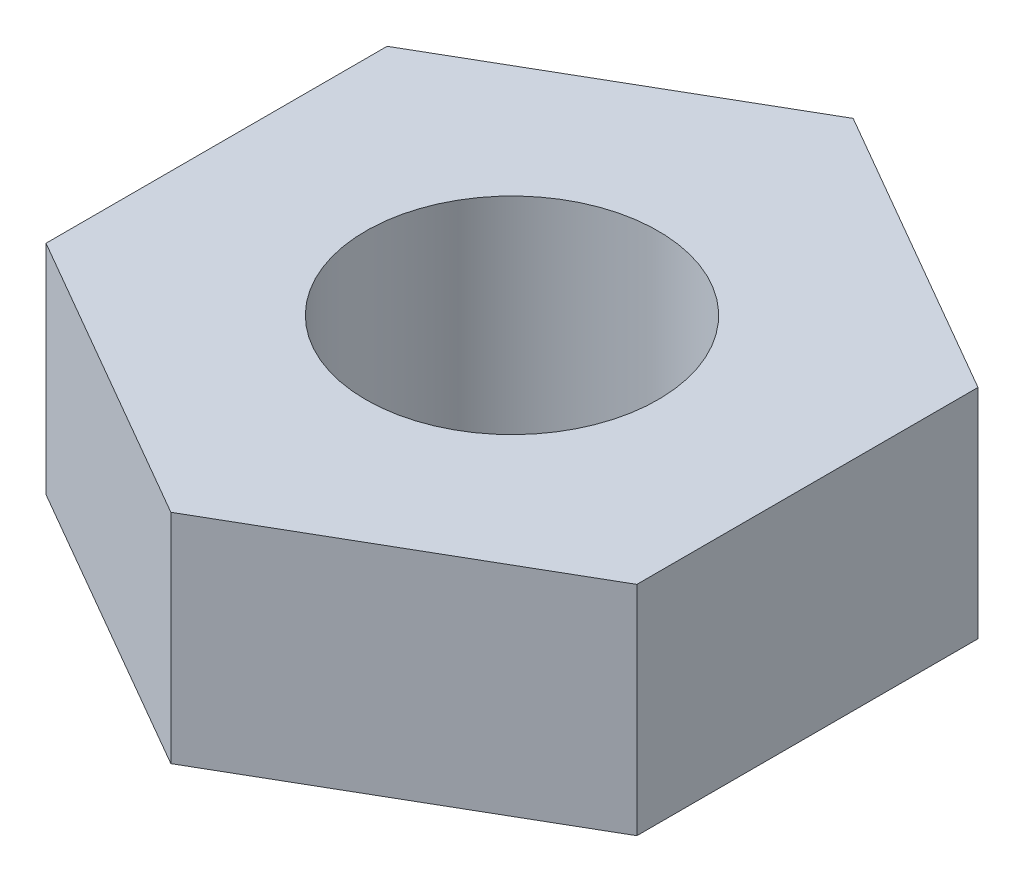
ISO-10303-21;
HEADER;
FILE_DESCRIPTION(('STEP AP214'),'2;1');
FILE_NAME('part.step','',(''),(''),'','','');
FILE_SCHEMA(('AUTOMOTIVE_DESIGN { 1 0 10303 214 1 1 1 1 }'));
ENDSEC;
DATA;
#1=APPLICATION_CONTEXT('core data for automotive mechanical design processes');
#2=APPLICATION_PROTOCOL_DEFINITION('international standard','automotive_design',2000,#1);
#3=PRODUCT_CONTEXT('',#1,'mechanical');
#4=PRODUCT('Part','Part','',(#3));
#5=PRODUCT_RELATED_PRODUCT_CATEGORY('part','',(#4));
#6=PRODUCT_DEFINITION_FORMATION('','',#4);
#7=PRODUCT_DEFINITION_CONTEXT('part definition',#1,'design');
#8=PRODUCT_DEFINITION('design','',#6,#7);
#9=PRODUCT_DEFINITION_SHAPE('','',#8);
#10=(LENGTH_UNIT() NAMED_UNIT(*) SI_UNIT(.MILLI.,.METRE.));
#11=(NAMED_UNIT(*) PLANE_ANGLE_UNIT() SI_UNIT($,.RADIAN.));
#12=(NAMED_UNIT(*) SI_UNIT($,.STERADIAN.) SOLID_ANGLE_UNIT());
#13=UNCERTAINTY_MEASURE_WITH_UNIT(LENGTH_MEASURE(1.E-05),#10,'distance_accuracy_value','');
#14=(GEOMETRIC_REPRESENTATION_CONTEXT(3) GLOBAL_UNCERTAINTY_ASSIGNED_CONTEXT((#13)) GLOBAL_UNIT_ASSIGNED_CONTEXT((#10,
#11,#12)) REPRESENTATION_CONTEXT('',''));
#15=CARTESIAN_POINT('',(0.,0.,0.));
#16=DIRECTION('',(0.,0.,1.));
#17=DIRECTION('',(1.,0.,0.));
#18=AXIS2_PLACEMENT_3D('',#15,#16,#17);
#19=CARTESIAN_POINT('',(0.,3.5,0.));
#20=DIRECTION('',(0.,1.,0.));
#21=DIRECTION('',(0.,0.,1.));
#22=AXIS2_PLACEMENT_3D('',#19,#20,#21);
#23=PLANE('',#22);
#24=DIRECTION('',(-0.866025403784439,0.,-0.5));
#25=VECTOR('',#24,1.);
#26=CARTESIAN_POINT('',(4.75,3.5,-2.74241377865072));
#27=LINE('',#26,#25);
#28=CARTESIAN_POINT('',(4.75,3.5,-2.74241377865072));
#29=VERTEX_POINT('',#28);
#30=CARTESIAN_POINT('',(0.,3.5,-5.48482755730144));
#31=VERTEX_POINT('',#30);
#32=EDGE_CURVE('E129',#29,#31,#27,.T.);
#33=ORIENTED_EDGE('',*,*,#32,.T.);
#34=DIRECTION('',(-0.866025403784438,0.,0.5));
#35=VECTOR('',#34,1.);
#36=CARTESIAN_POINT('',(0.,3.5,-5.48482755730144));
#37=LINE('',#36,#35);
#38=CARTESIAN_POINT('',(-4.75,3.5,-2.74241377865072));
#39=VERTEX_POINT('',#38);
#40=EDGE_CURVE('E87',#31,#39,#37,.T.);
#41=ORIENTED_EDGE('',*,*,#40,.T.);
#42=DIRECTION('',(0.,0.,1.));
#43=VECTOR('',#42,1.);
#44=CARTESIAN_POINT('',(-4.75,3.5,-2.74241377865072));
#45=LINE('',#44,#43);
#46=CARTESIAN_POINT('',(-4.75,3.5,2.74241377865072));
#47=VERTEX_POINT('',#46);
#48=EDGE_CURVE('E100',#39,#47,#45,.T.);
#49=ORIENTED_EDGE('',*,*,#48,.T.);
#50=DIRECTION('',(0.866025403784439,0.,0.5));
#51=VECTOR('',#50,1.);
#52=CARTESIAN_POINT('',(-4.75,3.5,2.74241377865072));
#53=LINE('',#52,#51);
#54=CARTESIAN_POINT('',(0.,3.5,5.48482755730144));
#55=VERTEX_POINT('',#54);
#56=EDGE_CURVE('E94',#47,#55,#53,.T.);
#57=ORIENTED_EDGE('',*,*,#56,.T.);
#58=DIRECTION('',(0.866025403784439,0.,-0.5));
#59=VECTOR('',#58,1.);
#60=CARTESIAN_POINT('',(0.,3.5,5.48482755730144));
#61=LINE('',#60,#59);
#62=CARTESIAN_POINT('',(4.75,3.5,2.74241377865072));
#63=VERTEX_POINT('',#62);
#64=EDGE_CURVE('E98',#55,#63,#61,.T.);
#65=ORIENTED_EDGE('',*,*,#64,.T.);
#66=DIRECTION('',(0.,0.,-1.));
#67=VECTOR('',#66,1.);
#68=CARTESIAN_POINT('',(4.75,3.5,2.74241377865072));
#69=LINE('',#68,#67);
#70=EDGE_CURVE('E50',#63,#29,#69,.T.);
#71=ORIENTED_EDGE('',*,*,#70,.T.);
#72=EDGE_LOOP('',(#33,#41,#49,#57,#65,#71));
#73=FACE_BOUND('',#72,.T.);
#74=CARTESIAN_POINT('',(0.,3.5,0.));
#75=DIRECTION('',(0.,1.,0.));
#76=DIRECTION('',(0.,0.,1.));
#77=AXIS2_PLACEMENT_3D('',#74,#75,#76);
#78=CIRCLE('',#77,2.35);
#79=CARTESIAN_POINT('',(0.,3.5,2.35));
#80=VERTEX_POINT('',#79);
#81=EDGE_CURVE('E122',#80,#80,#78,.T.);
#82=ORIENTED_EDGE('',*,*,#81,.F.);
#83=EDGE_LOOP('',(#82));
#84=FACE_BOUND('',#83,.T.);
#85=ADVANCED_FACE('F33',(#73,#84),#23,.T.);
#86=CARTESIAN_POINT('',(0.,0.,0.));
#87=DIRECTION('',(0.,1.,0.));
#88=DIRECTION('',(0.,0.,1.));
#89=AXIS2_PLACEMENT_3D('',#86,#87,#88);
#90=PLANE('',#89);
#91=DIRECTION('',(-0.866025403784439,0.,-0.5));
#92=VECTOR('',#91,1.);
#93=CARTESIAN_POINT('',(4.75,0.,-2.74241377865072));
#94=LINE('',#93,#92);
#95=CARTESIAN_POINT('',(4.75,0.,-2.74241377865072));
#96=VERTEX_POINT('',#95);
#97=CARTESIAN_POINT('',(0.,0.,-5.48482755730144));
#98=VERTEX_POINT('',#97);
#99=EDGE_CURVE('E118',#96,#98,#94,.T.);
#100=ORIENTED_EDGE('',*,*,#99,.F.);
#101=DIRECTION('',(0.,0.,-1.));
#102=VECTOR('',#101,1.);
#103=CARTESIAN_POINT('',(4.75,0.,2.74241377865072));
#104=LINE('',#103,#102);
#105=CARTESIAN_POINT('',(4.75,0.,2.74241377865072));
#106=VERTEX_POINT('',#105);
#107=EDGE_CURVE('E79',#106,#96,#104,.T.);
#108=ORIENTED_EDGE('',*,*,#107,.F.);
#109=DIRECTION('',(0.866025403784439,0.,-0.5));
#110=VECTOR('',#109,1.);
#111=CARTESIAN_POINT('',(0.,0.,5.48482755730144));
#112=LINE('',#111,#110);
#113=CARTESIAN_POINT('',(0.,0.,5.48482755730144));
#114=VERTEX_POINT('',#113);
#115=EDGE_CURVE('E73',#114,#106,#112,.T.);
#116=ORIENTED_EDGE('',*,*,#115,.F.);
#117=DIRECTION('',(0.866025403784439,0.,0.5));
#118=VECTOR('',#117,1.);
#119=CARTESIAN_POINT('',(-4.75,0.,2.74241377865072));
#120=LINE('',#119,#118);
#121=CARTESIAN_POINT('',(-4.75,0.,2.74241377865072));
#122=VERTEX_POINT('',#121);
#123=EDGE_CURVE('E108',#122,#114,#120,.T.);
#124=ORIENTED_EDGE('',*,*,#123,.F.);
#125=DIRECTION('',(0.,0.,1.));
#126=VECTOR('',#125,1.);
#127=CARTESIAN_POINT('',(-4.75,0.,-2.74241377865072));
#128=LINE('',#127,#126);
#129=CARTESIAN_POINT('',(-4.75,0.,-2.74241377865072));
#130=VERTEX_POINT('',#129);
#131=EDGE_CURVE('E124',#130,#122,#128,.T.);
#132=ORIENTED_EDGE('',*,*,#131,.F.);
#133=DIRECTION('',(-0.866025403784438,0.,0.5));
#134=VECTOR('',#133,1.);
#135=CARTESIAN_POINT('',(0.,0.,-5.48482755730144));
#136=LINE('',#135,#134);
#137=EDGE_CURVE('E121',#98,#130,#136,.T.);
#138=ORIENTED_EDGE('',*,*,#137,.F.);
#139=EDGE_LOOP('',(#100,#108,#116,#124,#132,#138));
#140=FACE_BOUND('',#139,.T.);
#141=CARTESIAN_POINT('',(0.,0.,0.));
#142=DIRECTION('',(0.,1.,0.));
#143=DIRECTION('',(0.,0.,1.));
#144=AXIS2_PLACEMENT_3D('',#141,#142,#143);
#145=CIRCLE('',#144,2.35);
#146=CARTESIAN_POINT('',(0.,0.,2.35));
#147=VERTEX_POINT('',#146);
#148=EDGE_CURVE('E222',#147,#147,#145,.T.);
#149=ORIENTED_EDGE('',*,*,#148,.T.);
#150=EDGE_LOOP('',(#149));
#151=FACE_BOUND('',#150,.T.);
#152=ADVANCED_FACE('F138',(#140,#151),#90,.F.);
#153=CARTESIAN_POINT('',(4.75,3.5,-2.74241377865072));
#154=DIRECTION('',(-0.5,0.,0.866025403784439));
#155=DIRECTION('',(0.866025403784439,0.,0.5));
#156=AXIS2_PLACEMENT_3D('',#153,#154,#155);
#157=PLANE('',#156);
#158=ORIENTED_EDGE('',*,*,#99,.T.);
#159=DIRECTION('',(0.,-1.,0.));
#160=VECTOR('',#159,1.);
#161=CARTESIAN_POINT('',(0.,3.5,-5.48482755730144));
#162=LINE('',#161,#160);
#163=EDGE_CURVE('E11',#31,#98,#162,.T.);
#164=ORIENTED_EDGE('',*,*,#163,.F.);
#165=ORIENTED_EDGE('',*,*,#32,.F.);
#166=DIRECTION('',(0.,-1.,0.));
#167=VECTOR('',#166,1.);
#168=CARTESIAN_POINT('',(4.75,3.5,-2.74241377865072));
#169=LINE('',#168,#167);
#170=EDGE_CURVE('E114',#29,#96,#169,.T.);
#171=ORIENTED_EDGE('',*,*,#170,.T.);
#172=EDGE_LOOP('',(#158,#164,#165,#171));
#173=FACE_BOUND('',#172,.T.);
#174=ADVANCED_FACE('F35',(#173),#157,.F.);
#175=CARTESIAN_POINT('',(0.,3.5,-5.48482755730144));
#176=DIRECTION('',(0.5,0.,0.866025403784438));
#177=DIRECTION('',(0.866025403784439,0.,-0.5));
#178=AXIS2_PLACEMENT_3D('',#175,#176,#177);
#179=PLANE('',#178);
#180=ORIENTED_EDGE('',*,*,#137,.T.);
#181=DIRECTION('',(0.,-1.,0.));
#182=VECTOR('',#181,1.);
#183=CARTESIAN_POINT('',(-4.75,3.5,-2.74241377865072));
#184=LINE('',#183,#182);
#185=EDGE_CURVE('E42',#39,#130,#184,.T.);
#186=ORIENTED_EDGE('',*,*,#185,.F.);
#187=ORIENTED_EDGE('',*,*,#40,.F.);
#188=ORIENTED_EDGE('',*,*,#163,.T.);
#189=EDGE_LOOP('',(#180,#186,#187,#188));
#190=FACE_BOUND('',#189,.T.);
#191=ADVANCED_FACE('F163',(#190),#179,.F.);
#192=CARTESIAN_POINT('',(-4.75,3.5,-2.74241377865072));
#193=DIRECTION('',(1.,0.,0.));
#194=DIRECTION('',(0.,0.,-1.));
#195=AXIS2_PLACEMENT_3D('',#192,#193,#194);
#196=PLANE('',#195);
#197=ORIENTED_EDGE('',*,*,#131,.T.);
#198=DIRECTION('',(0.,-1.,0.));
#199=VECTOR('',#198,1.);
#200=CARTESIAN_POINT('',(-4.75,3.5,2.74241377865072));
#201=LINE('',#200,#199);
#202=EDGE_CURVE('E109',#47,#122,#201,.T.);
#203=ORIENTED_EDGE('',*,*,#202,.F.);
#204=ORIENTED_EDGE('',*,*,#48,.F.);
#205=ORIENTED_EDGE('',*,*,#185,.T.);
#206=EDGE_LOOP('',(#197,#203,#204,#205));
#207=FACE_BOUND('',#206,.T.);
#208=ADVANCED_FACE('F135',(#207),#196,.F.);
#209=CARTESIAN_POINT('',(-4.75,3.5,2.74241377865072));
#210=DIRECTION('',(0.5,0.,-0.866025403784439));
#211=DIRECTION('',(-0.866025403784439,0.,-0.5));
#212=AXIS2_PLACEMENT_3D('',#209,#210,#211);
#213=PLANE('',#212);
#214=ORIENTED_EDGE('',*,*,#123,.T.);
#215=DIRECTION('',(0.,-1.,0.));
#216=VECTOR('',#215,1.);
#217=CARTESIAN_POINT('',(0.,3.5,5.48482755730144));
#218=LINE('',#217,#216);
#219=EDGE_CURVE('E105',#55,#114,#218,.T.);
#220=ORIENTED_EDGE('',*,*,#219,.F.);
#221=ORIENTED_EDGE('',*,*,#56,.F.);
#222=ORIENTED_EDGE('',*,*,#202,.T.);
#223=EDGE_LOOP('',(#214,#220,#221,#222));
#224=FACE_BOUND('',#223,.T.);
#225=ADVANCED_FACE('F106',(#224),#213,.F.);
#226=CARTESIAN_POINT('',(0.,3.5,5.48482755730144));
#227=DIRECTION('',(-0.5,0.,-0.866025403784439));
#228=DIRECTION('',(-0.866025403784439,0.,0.5));
#229=AXIS2_PLACEMENT_3D('',#226,#227,#228);
#230=PLANE('',#229);
#231=ORIENTED_EDGE('',*,*,#115,.T.);
#232=DIRECTION('',(0.,-1.,0.));
#233=VECTOR('',#232,1.);
#234=CARTESIAN_POINT('',(4.75,3.5,2.74241377865072));
#235=LINE('',#234,#233);
#236=EDGE_CURVE('E110',#63,#106,#235,.T.);
#237=ORIENTED_EDGE('',*,*,#236,.F.);
#238=ORIENTED_EDGE('',*,*,#64,.F.);
#239=ORIENTED_EDGE('',*,*,#219,.T.);
#240=EDGE_LOOP('',(#231,#237,#238,#239));
#241=FACE_BOUND('',#240,.T.);
#242=ADVANCED_FACE('F112',(#241),#230,.F.);
#243=CARTESIAN_POINT('',(4.75,3.5,2.74241377865072));
#244=DIRECTION('',(-1.,0.,0.));
#245=DIRECTION('',(0.,0.,1.));
#246=AXIS2_PLACEMENT_3D('',#243,#244,#245);
#247=PLANE('',#246);
#248=ORIENTED_EDGE('',*,*,#107,.T.);
#249=ORIENTED_EDGE('',*,*,#170,.F.);
#250=ORIENTED_EDGE('',*,*,#70,.F.);
#251=ORIENTED_EDGE('',*,*,#236,.T.);
#252=EDGE_LOOP('',(#248,#249,#250,#251));
#253=FACE_BOUND('',#252,.T.);
#254=ADVANCED_FACE('F143',(#253),#247,.F.);
#255=CARTESIAN_POINT('',(0.,3.5,0.));
#256=DIRECTION('',(0.,-1.,0.));
#257=DIRECTION('',(0.,0.,-1.));
#258=AXIS2_PLACEMENT_3D('',#255,#256,#257);
#259=CYLINDRICAL_SURFACE('',#258,2.35);
#260=ORIENTED_EDGE('',*,*,#81,.T.);
#261=EDGE_LOOP('',(#260));
#262=FACE_BOUND('',#261,.T.);
#263=ORIENTED_EDGE('',*,*,#148,.F.);
#264=EDGE_LOOP('',(#263));
#265=FACE_BOUND('',#264,.T.);
#266=ADVANCED_FACE('F145',(#262,#265),#259,.F.);
#267=CLOSED_SHELL('',(#85,#152,#174,#191,#208,#225,#242,#254,#266));
#268=MANIFOLD_SOLID_BREP('B2',#267);
#269=ADVANCED_BREP_SHAPE_REPRESENTATION('',(#18,#268),#14);
#270=SHAPE_DEFINITION_REPRESENTATION(#9,#269);
ENDSEC;
END-ISO-10303-21;
